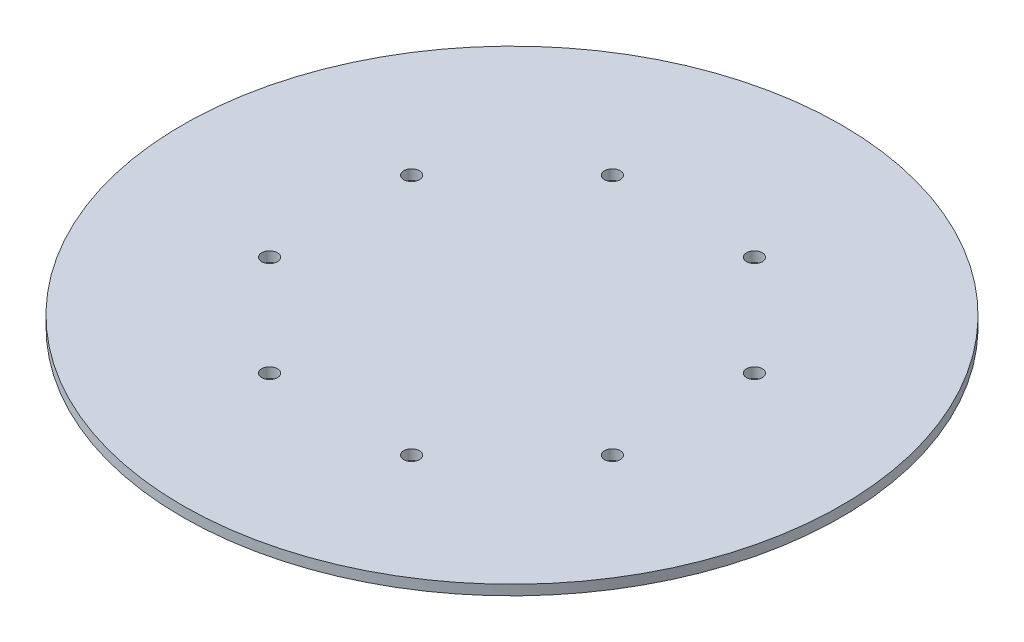
ISO-10303-21;
HEADER;
FILE_DESCRIPTION(('STEP AP214'),'2;1');
FILE_NAME('part.step','',(''),(''),'','','');
FILE_SCHEMA(('AUTOMOTIVE_DESIGN { 1 0 10303 214 1 1 1 1 }'));
ENDSEC;
DATA;
#1=APPLICATION_CONTEXT('core data for automotive mechanical design processes');
#2=APPLICATION_PROTOCOL_DEFINITION('international standard','automotive_design',2000,#1);
#3=PRODUCT_CONTEXT('',#1,'mechanical');
#4=PRODUCT('Part','Part','',(#3));
#5=PRODUCT_RELATED_PRODUCT_CATEGORY('part','',(#4));
#6=PRODUCT_DEFINITION_FORMATION('','',#4);
#7=PRODUCT_DEFINITION_CONTEXT('part definition',#1,'design');
#8=PRODUCT_DEFINITION('design','',#6,#7);
#9=PRODUCT_DEFINITION_SHAPE('','',#8);
#10=(LENGTH_UNIT() NAMED_UNIT(*) SI_UNIT(.MILLI.,.METRE.));
#11=(NAMED_UNIT(*) PLANE_ANGLE_UNIT() SI_UNIT($,.RADIAN.));
#12=(NAMED_UNIT(*) SI_UNIT($,.STERADIAN.) SOLID_ANGLE_UNIT());
#13=UNCERTAINTY_MEASURE_WITH_UNIT(LENGTH_MEASURE(1.E-05),#10,'distance_accuracy_value','');
#14=(GEOMETRIC_REPRESENTATION_CONTEXT(3) GLOBAL_UNCERTAINTY_ASSIGNED_CONTEXT((#13)) GLOBAL_UNIT_ASSIGNED_CONTEXT((#10,
#11,#12)) REPRESENTATION_CONTEXT('',''));
#15=CARTESIAN_POINT('',(0.,0.,0.));
#16=DIRECTION('',(0.,0.,1.));
#17=DIRECTION('',(1.,0.,0.));
#18=AXIS2_PLACEMENT_3D('',#15,#16,#17);
#19=CARTESIAN_POINT('',(0.,1.6,2.89698820488127E-13));
#20=DIRECTION('',(0.,-1.,0.));
#21=DIRECTION('',(0.,0.,-1.));
#22=AXIS2_PLACEMENT_3D('',#19,#20,#21);
#23=CYLINDRICAL_SURFACE('',#22,52.5000000000002);
#24=CARTESIAN_POINT('',(0.,1.6,2.89698820488127E-13));
#25=DIRECTION('',(0.,1.,0.));
#26=DIRECTION('',(0.,0.,1.));
#27=AXIS2_PLACEMENT_3D('',#24,#25,#26);
#28=CIRCLE('',#27,52.5000000000002);
#29=CARTESIAN_POINT('',(0.,1.6,52.5000000000005));
#30=VERTEX_POINT('',#29);
#31=EDGE_CURVE('E11',#30,#30,#28,.T.);
#32=ORIENTED_EDGE('',*,*,#31,.F.);
#33=EDGE_LOOP('',(#32));
#34=FACE_BOUND('',#33,.T.);
#35=CARTESIAN_POINT('',(0.,0.,2.89698820488127E-13));
#36=DIRECTION('',(0.,1.,0.));
#37=DIRECTION('',(0.,0.,1.));
#38=AXIS2_PLACEMENT_3D('',#35,#36,#37);
#39=CIRCLE('',#38,52.5000000000002);
#40=CARTESIAN_POINT('',(0.,0.,52.5000000000005));
#41=VERTEX_POINT('',#40);
#42=EDGE_CURVE('E59',#41,#41,#39,.T.);
#43=ORIENTED_EDGE('',*,*,#42,.T.);
#44=EDGE_LOOP('',(#43));
#45=FACE_BOUND('',#44,.T.);
#46=ADVANCED_FACE('F55',(#34,#45),#23,.T.);
#47=CARTESIAN_POINT('',(11.3124739155538,1.6,27.3107279509232));
#48=DIRECTION('',(0.,-1.,0.));
#49=DIRECTION('',(0.,0.,-1.));
#50=AXIS2_PLACEMENT_3D('',#47,#48,#49);
#51=CYLINDRICAL_SURFACE('',#50,1.25000000000011);
#52=CARTESIAN_POINT('',(11.3124739155538,1.6,27.3107279509232));
#53=DIRECTION('',(0.,1.,0.));
#54=DIRECTION('',(0.,0.,1.));
#55=AXIS2_PLACEMENT_3D('',#52,#53,#54);
#56=CIRCLE('',#55,1.25000000000011);
#57=CARTESIAN_POINT('',(11.3124739155538,1.6,28.5607279509233));
#58=VERTEX_POINT('',#57);
#59=EDGE_CURVE('E64',#58,#58,#56,.T.);
#60=ORIENTED_EDGE('',*,*,#59,.T.);
#61=EDGE_LOOP('',(#60));
#62=FACE_BOUND('',#61,.T.);
#63=CARTESIAN_POINT('',(11.3124739155538,0.,27.3107279509232));
#64=DIRECTION('',(0.,1.,0.));
#65=DIRECTION('',(0.,0.,1.));
#66=AXIS2_PLACEMENT_3D('',#63,#64,#65);
#67=CIRCLE('',#66,1.25000000000011);
#68=CARTESIAN_POINT('',(11.3124739155538,0.,28.5607279509233));
#69=VERTEX_POINT('',#68);
#70=EDGE_CURVE('E101',#69,#69,#67,.T.);
#71=ORIENTED_EDGE('',*,*,#70,.F.);
#72=EDGE_LOOP('',(#71));
#73=FACE_BOUND('',#72,.T.);
#74=ADVANCED_FACE('F151',(#62,#73),#51,.F.);
#75=CARTESIAN_POINT('',(-11.3124739155551,1.6,27.3107279509237));
#76=DIRECTION('',(0.,-1.,0.));
#77=DIRECTION('',(0.,0.,-1.));
#78=AXIS2_PLACEMENT_3D('',#75,#76,#77);
#79=CYLINDRICAL_SURFACE('',#78,1.25);
#80=CARTESIAN_POINT('',(-11.3124739155551,1.6,27.3107279509237));
#81=DIRECTION('',(0.,1.,0.));
#82=DIRECTION('',(0.,0.,1.));
#83=AXIS2_PLACEMENT_3D('',#80,#81,#82);
#84=CIRCLE('',#83,1.25);
#85=CARTESIAN_POINT('',(-11.3124739155551,1.6,28.5607279509237));
#86=VERTEX_POINT('',#85);
#87=EDGE_CURVE('E70',#86,#86,#84,.T.);
#88=ORIENTED_EDGE('',*,*,#87,.T.);
#89=EDGE_LOOP('',(#88));
#90=FACE_BOUND('',#89,.T.);
#91=CARTESIAN_POINT('',(-11.3124739155551,0.,27.3107279509237));
#92=DIRECTION('',(0.,1.,0.));
#93=DIRECTION('',(0.,0.,1.));
#94=AXIS2_PLACEMENT_3D('',#91,#92,#93);
#95=CIRCLE('',#94,1.25);
#96=CARTESIAN_POINT('',(-11.3124739155551,0.,28.5607279509237));
#97=VERTEX_POINT('',#96);
#98=EDGE_CURVE('E98',#97,#97,#95,.T.);
#99=ORIENTED_EDGE('',*,*,#98,.F.);
#100=EDGE_LOOP('',(#99));
#101=FACE_BOUND('',#100,.T.);
#102=ADVANCED_FACE('F140',(#90,#101),#79,.F.);
#103=CARTESIAN_POINT('',(-27.3107279509241,1.6,11.3124739155541));
#104=DIRECTION('',(0.,-1.,0.));
#105=DIRECTION('',(0.,0.,-1.));
#106=AXIS2_PLACEMENT_3D('',#103,#104,#105);
#107=CYLINDRICAL_SURFACE('',#106,1.25);
#108=CARTESIAN_POINT('',(-27.3107279509241,1.6,11.3124739155541));
#109=DIRECTION('',(0.,1.,0.));
#110=DIRECTION('',(0.,0.,1.));
#111=AXIS2_PLACEMENT_3D('',#108,#109,#110);
#112=CIRCLE('',#111,1.25);
#113=CARTESIAN_POINT('',(-27.3107279509241,1.6,12.5624739155541));
#114=VERTEX_POINT('',#113);
#115=EDGE_CURVE('E133',#114,#114,#112,.T.);
#116=ORIENTED_EDGE('',*,*,#115,.T.);
#117=EDGE_LOOP('',(#116));
#118=FACE_BOUND('',#117,.T.);
#119=CARTESIAN_POINT('',(-27.3107279509241,0.,11.3124739155541));
#120=DIRECTION('',(0.,1.,0.));
#121=DIRECTION('',(0.,0.,1.));
#122=AXIS2_PLACEMENT_3D('',#119,#120,#121);
#123=CIRCLE('',#122,1.25);
#124=CARTESIAN_POINT('',(-27.3107279509241,0.,12.5624739155541));
#125=VERTEX_POINT('',#124);
#126=EDGE_CURVE('E94',#125,#125,#123,.T.);
#127=ORIENTED_EDGE('',*,*,#126,.F.);
#128=EDGE_LOOP('',(#127));
#129=FACE_BOUND('',#128,.T.);
#130=ADVANCED_FACE('F159',(#118,#129),#107,.F.);
#131=CARTESIAN_POINT('',(-27.3107279509236,1.6,-11.3124739155552));
#132=DIRECTION('',(0.,-1.,0.));
#133=DIRECTION('',(0.,0.,-1.));
#134=AXIS2_PLACEMENT_3D('',#131,#132,#133);
#135=CYLINDRICAL_SURFACE('',#134,1.25);
#136=CARTESIAN_POINT('',(-27.3107279509236,1.6,-11.3124739155552));
#137=DIRECTION('',(0.,1.,0.));
#138=DIRECTION('',(0.,0.,1.));
#139=AXIS2_PLACEMENT_3D('',#136,#137,#138);
#140=CIRCLE('',#139,1.25);
#141=CARTESIAN_POINT('',(-27.3107279509236,1.6,-10.0624739155552));
#142=VERTEX_POINT('',#141);
#143=EDGE_CURVE('E129',#142,#142,#140,.T.);
#144=ORIENTED_EDGE('',*,*,#143,.T.);
#145=EDGE_LOOP('',(#144));
#146=FACE_BOUND('',#145,.T.);
#147=CARTESIAN_POINT('',(-27.3107279509236,0.,-11.3124739155552));
#148=DIRECTION('',(0.,1.,0.));
#149=DIRECTION('',(0.,0.,1.));
#150=AXIS2_PLACEMENT_3D('',#147,#148,#149);
#151=CIRCLE('',#150,1.25);
#152=CARTESIAN_POINT('',(-27.3107279509236,0.,-10.0624739155552));
#153=VERTEX_POINT('',#152);
#154=EDGE_CURVE('E90',#153,#153,#151,.T.);
#155=ORIENTED_EDGE('',*,*,#154,.F.);
#156=EDGE_LOOP('',(#155));
#157=FACE_BOUND('',#156,.T.);
#158=ADVANCED_FACE('F167',(#146,#157),#135,.F.);
#159=CARTESIAN_POINT('',(-11.312473915554,1.6,-27.3107279509241));
#160=DIRECTION('',(0.,-1.,0.));
#161=DIRECTION('',(0.,0.,-1.));
#162=AXIS2_PLACEMENT_3D('',#159,#160,#161);
#163=CYLINDRICAL_SURFACE('',#162,1.25);
#164=CARTESIAN_POINT('',(-11.312473915554,1.6,-27.3107279509241));
#165=DIRECTION('',(0.,1.,0.));
#166=DIRECTION('',(0.,0.,1.));
#167=AXIS2_PLACEMENT_3D('',#164,#165,#166);
#168=CIRCLE('',#167,1.25);
#169=CARTESIAN_POINT('',(-11.312473915554,1.6,-26.0607279509241));
#170=VERTEX_POINT('',#169);
#171=EDGE_CURVE('E125',#170,#170,#168,.T.);
#172=ORIENTED_EDGE('',*,*,#171,.T.);
#173=EDGE_LOOP('',(#172));
#174=FACE_BOUND('',#173,.T.);
#175=CARTESIAN_POINT('',(-11.312473915554,0.,-27.3107279509241));
#176=DIRECTION('',(0.,1.,0.));
#177=DIRECTION('',(0.,0.,1.));
#178=AXIS2_PLACEMENT_3D('',#175,#176,#177);
#179=CIRCLE('',#178,1.25);
#180=CARTESIAN_POINT('',(-11.312473915554,0.,-26.0607279509241));
#181=VERTEX_POINT('',#180);
#182=EDGE_CURVE('E86',#181,#181,#179,.T.);
#183=ORIENTED_EDGE('',*,*,#182,.F.);
#184=EDGE_LOOP('',(#183));
#185=FACE_BOUND('',#184,.T.);
#186=ADVANCED_FACE('F171',(#174,#185),#163,.F.);
#187=CARTESIAN_POINT('',(11.3124739155553,1.6,-27.3107279509236));
#188=DIRECTION('',(0.,-1.,0.));
#189=DIRECTION('',(0.,0.,-1.));
#190=AXIS2_PLACEMENT_3D('',#187,#188,#189);
#191=CYLINDRICAL_SURFACE('',#190,1.25);
#192=CARTESIAN_POINT('',(11.3124739155553,1.6,-27.3107279509236));
#193=DIRECTION('',(0.,1.,0.));
#194=DIRECTION('',(0.,0.,1.));
#195=AXIS2_PLACEMENT_3D('',#192,#193,#194);
#196=CIRCLE('',#195,1.25);
#197=CARTESIAN_POINT('',(11.3124739155553,1.6,-26.0607279509236));
#198=VERTEX_POINT('',#197);
#199=EDGE_CURVE('E119',#198,#198,#196,.T.);
#200=ORIENTED_EDGE('',*,*,#199,.T.);
#201=EDGE_LOOP('',(#200));
#202=FACE_BOUND('',#201,.T.);
#203=CARTESIAN_POINT('',(11.3124739155553,0.,-27.3107279509236));
#204=DIRECTION('',(0.,1.,0.));
#205=DIRECTION('',(0.,0.,1.));
#206=AXIS2_PLACEMENT_3D('',#203,#204,#205);
#207=CIRCLE('',#206,1.25);
#208=CARTESIAN_POINT('',(11.3124739155553,0.,-26.0607279509236));
#209=VERTEX_POINT('',#208);
#210=EDGE_CURVE('E82',#209,#209,#207,.T.);
#211=ORIENTED_EDGE('',*,*,#210,.F.);
#212=EDGE_LOOP('',(#211));
#213=FACE_BOUND('',#212,.T.);
#214=ADVANCED_FACE('F175',(#202,#213),#191,.F.);
#215=CARTESIAN_POINT('',(27.3107279509242,1.6,-11.3124739155539));
#216=DIRECTION('',(0.,-1.,0.));
#217=DIRECTION('',(0.,0.,-1.));
#218=AXIS2_PLACEMENT_3D('',#215,#216,#217);
#219=CYLINDRICAL_SURFACE('',#218,1.25);
#220=CARTESIAN_POINT('',(27.3107279509242,1.6,-11.3124739155539));
#221=DIRECTION('',(0.,1.,0.));
#222=DIRECTION('',(0.,0.,1.));
#223=AXIS2_PLACEMENT_3D('',#220,#221,#222);
#224=CIRCLE('',#223,1.25);
#225=CARTESIAN_POINT('',(27.3107279509242,1.6,-10.0624739155539));
#226=VERTEX_POINT('',#225);
#227=EDGE_CURVE('E113',#226,#226,#224,.T.);
#228=ORIENTED_EDGE('',*,*,#227,.T.);
#229=EDGE_LOOP('',(#228));
#230=FACE_BOUND('',#229,.T.);
#231=CARTESIAN_POINT('',(27.3107279509242,0.,-11.3124739155539));
#232=DIRECTION('',(0.,1.,0.));
#233=DIRECTION('',(0.,0.,1.));
#234=AXIS2_PLACEMENT_3D('',#231,#232,#233);
#235=CIRCLE('',#234,1.25);
#236=CARTESIAN_POINT('',(27.3107279509242,0.,-10.0624739155539));
#237=VERTEX_POINT('',#236);
#238=EDGE_CURVE('E78',#237,#237,#235,.T.);
#239=ORIENTED_EDGE('',*,*,#238,.F.);
#240=EDGE_LOOP('',(#239));
#241=FACE_BOUND('',#240,.T.);
#242=ADVANCED_FACE('F178',(#230,#241),#219,.F.);
#243=CARTESIAN_POINT('',(27.3107279509236,1.6,11.3124739155554));
#244=DIRECTION('',(0.,-1.,0.));
#245=DIRECTION('',(0.,0.,-1.));
#246=AXIS2_PLACEMENT_3D('',#243,#244,#245);
#247=CYLINDRICAL_SURFACE('',#246,1.25);
#248=CARTESIAN_POINT('',(27.3107279509236,1.6,11.3124739155554));
#249=DIRECTION('',(0.,1.,0.));
#250=DIRECTION('',(0.,0.,1.));
#251=AXIS2_PLACEMENT_3D('',#248,#249,#250);
#252=CIRCLE('',#251,1.25);
#253=CARTESIAN_POINT('',(27.3107279509236,1.6,12.5624739155554));
#254=VERTEX_POINT('',#253);
#255=EDGE_CURVE('E108',#254,#254,#252,.T.);
#256=ORIENTED_EDGE('',*,*,#255,.T.);
#257=EDGE_LOOP('',(#256));
#258=FACE_BOUND('',#257,.T.);
#259=CARTESIAN_POINT('',(27.3107279509236,0.,11.3124739155554));
#260=DIRECTION('',(0.,1.,0.));
#261=DIRECTION('',(0.,0.,1.));
#262=AXIS2_PLACEMENT_3D('',#259,#260,#261);
#263=CIRCLE('',#262,1.25);
#264=CARTESIAN_POINT('',(27.3107279509236,0.,12.5624739155554));
#265=VERTEX_POINT('',#264);
#266=EDGE_CURVE('E74',#265,#265,#263,.T.);
#267=ORIENTED_EDGE('',*,*,#266,.F.);
#268=EDGE_LOOP('',(#267));
#269=FACE_BOUND('',#268,.T.);
#270=ADVANCED_FACE('F57',(#258,#269),#247,.F.);
#271=CARTESIAN_POINT('',(0.,0.,0.));
#272=DIRECTION('',(0.,1.,0.));
#273=DIRECTION('',(0.,0.,1.));
#274=AXIS2_PLACEMENT_3D('',#271,#272,#273);
#275=PLANE('',#274);
#276=ORIENTED_EDGE('',*,*,#266,.T.);
#277=EDGE_LOOP('',(#276));
#278=FACE_BOUND('',#277,.T.);
#279=ORIENTED_EDGE('',*,*,#238,.T.);
#280=EDGE_LOOP('',(#279));
#281=FACE_BOUND('',#280,.T.);
#282=ORIENTED_EDGE('',*,*,#210,.T.);
#283=EDGE_LOOP('',(#282));
#284=FACE_BOUND('',#283,.T.);
#285=ORIENTED_EDGE('',*,*,#182,.T.);
#286=EDGE_LOOP('',(#285));
#287=FACE_BOUND('',#286,.T.);
#288=ORIENTED_EDGE('',*,*,#154,.T.);
#289=EDGE_LOOP('',(#288));
#290=FACE_BOUND('',#289,.T.);
#291=ORIENTED_EDGE('',*,*,#126,.T.);
#292=EDGE_LOOP('',(#291));
#293=FACE_BOUND('',#292,.T.);
#294=ORIENTED_EDGE('',*,*,#98,.T.);
#295=EDGE_LOOP('',(#294));
#296=FACE_BOUND('',#295,.T.);
#297=ORIENTED_EDGE('',*,*,#70,.T.);
#298=EDGE_LOOP('',(#297));
#299=FACE_BOUND('',#298,.T.);
#300=ORIENTED_EDGE('',*,*,#42,.F.);
#301=EDGE_LOOP('',(#300));
#302=FACE_BOUND('',#301,.T.);
#303=ADVANCED_FACE('F146',(#278,#281,#284,#287,#290,#293,#296,#299,#302),#275,.F.);
#304=CARTESIAN_POINT('',(0.,1.6,0.));
#305=DIRECTION('',(0.,1.,0.));
#306=DIRECTION('',(0.,0.,1.));
#307=AXIS2_PLACEMENT_3D('',#304,#305,#306);
#308=PLANE('',#307);
#309=ORIENTED_EDGE('',*,*,#255,.F.);
#310=EDGE_LOOP('',(#309));
#311=FACE_BOUND('',#310,.T.);
#312=ORIENTED_EDGE('',*,*,#227,.F.);
#313=EDGE_LOOP('',(#312));
#314=FACE_BOUND('',#313,.T.);
#315=ORIENTED_EDGE('',*,*,#199,.F.);
#316=EDGE_LOOP('',(#315));
#317=FACE_BOUND('',#316,.T.);
#318=ORIENTED_EDGE('',*,*,#171,.F.);
#319=EDGE_LOOP('',(#318));
#320=FACE_BOUND('',#319,.T.);
#321=ORIENTED_EDGE('',*,*,#143,.F.);
#322=EDGE_LOOP('',(#321));
#323=FACE_BOUND('',#322,.T.);
#324=ORIENTED_EDGE('',*,*,#115,.F.);
#325=EDGE_LOOP('',(#324));
#326=FACE_BOUND('',#325,.T.);
#327=ORIENTED_EDGE('',*,*,#87,.F.);
#328=EDGE_LOOP('',(#327));
#329=FACE_BOUND('',#328,.T.);
#330=ORIENTED_EDGE('',*,*,#59,.F.);
#331=EDGE_LOOP('',(#330));
#332=FACE_BOUND('',#331,.T.);
#333=ORIENTED_EDGE('',*,*,#31,.T.);
#334=EDGE_LOOP('',(#333));
#335=FACE_BOUND('',#334,.T.);
#336=ADVANCED_FACE('F143',(#311,#314,#317,#320,#323,#326,#329,#332,#335),#308,.T.);
#337=CLOSED_SHELL('',(#46,#74,#102,#130,#158,#186,#214,#242,#270,#303,#336));
#338=MANIFOLD_SOLID_BREP('B2',#337);
#339=ADVANCED_BREP_SHAPE_REPRESENTATION('',(#18,#338),#14);
#340=SHAPE_DEFINITION_REPRESENTATION(#9,#339);
ENDSEC;
END-ISO-10303-21;
